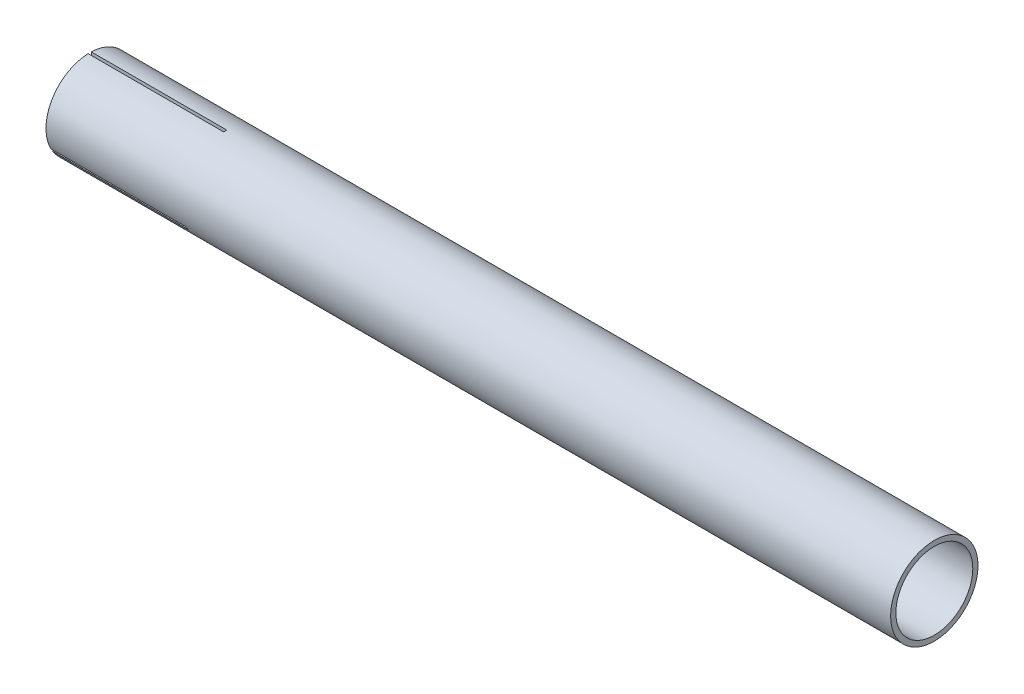
ISO-10303-21;
HEADER;
FILE_DESCRIPTION(('STEP AP214'),'2;1');
FILE_NAME('part.step','',(''),(''),'','','');
FILE_SCHEMA(('AUTOMOTIVE_DESIGN { 1 0 10303 214 1 1 1 1 }'));
ENDSEC;
DATA;
#1=APPLICATION_CONTEXT('core data for automotive mechanical design processes');
#2=APPLICATION_PROTOCOL_DEFINITION('international standard','automotive_design',2000,#1);
#3=PRODUCT_CONTEXT('',#1,'mechanical');
#4=PRODUCT('Part','Part','',(#3));
#5=PRODUCT_RELATED_PRODUCT_CATEGORY('part','',(#4));
#6=PRODUCT_DEFINITION_FORMATION('','',#4);
#7=PRODUCT_DEFINITION_CONTEXT('part definition',#1,'design');
#8=PRODUCT_DEFINITION('design','',#6,#7);
#9=PRODUCT_DEFINITION_SHAPE('','',#8);
#10=(LENGTH_UNIT() NAMED_UNIT(*) SI_UNIT(.MILLI.,.METRE.));
#11=(NAMED_UNIT(*) PLANE_ANGLE_UNIT() SI_UNIT($,.RADIAN.));
#12=(NAMED_UNIT(*) SI_UNIT($,.STERADIAN.) SOLID_ANGLE_UNIT());
#13=UNCERTAINTY_MEASURE_WITH_UNIT(LENGTH_MEASURE(1.E-05),#10,'distance_accuracy_value','');
#14=(GEOMETRIC_REPRESENTATION_CONTEXT(3) GLOBAL_UNCERTAINTY_ASSIGNED_CONTEXT((#13)) GLOBAL_UNIT_ASSIGNED_CONTEXT((#10,
#11,#12)) REPRESENTATION_CONTEXT('',''));
#15=CARTESIAN_POINT('',(0.,0.,0.));
#16=DIRECTION('',(0.,0.,1.));
#17=DIRECTION('',(1.,0.,0.));
#18=AXIS2_PLACEMENT_3D('',#15,#16,#17);
#19=CARTESIAN_POINT('',(810.,0.,0.));
#20=DIRECTION('',(-1.,0.,0.));
#21=DIRECTION('',(0.,0.,1.));
#22=AXIS2_PLACEMENT_3D('',#19,#20,#21);
#23=CYLINDRICAL_SURFACE('',#22,36.9);
#24=CARTESIAN_POINT('',(130.,0.,0.));
#25=DIRECTION('',(1.,0.,0.));
#26=DIRECTION('',(0.,0.,-1.));
#27=AXIS2_PLACEMENT_3D('',#24,#25,#26);
#28=CIRCLE('',#27,36.9);
#29=CARTESIAN_POINT('',(130.,36.8694995897693,-1.5));
#30=VERTEX_POINT('',#29);
#31=CARTESIAN_POINT('',(130.,36.8694995897693,1.5));
#32=VERTEX_POINT('',#31);
#33=EDGE_CURVE('E268',#30,#32,#28,.T.);
#34=ORIENTED_EDGE('',*,*,#33,.F.);
#35=DIRECTION('',(-1.,0.,0.));
#36=VECTOR('',#35,1.);
#37=CARTESIAN_POINT('',(810.,36.8694995897693,-1.5));
#38=LINE('',#37,#36);
#39=CARTESIAN_POINT('',(0.,36.8694995897693,-1.5));
#40=VERTEX_POINT('',#39);
#41=EDGE_CURVE('E116',#30,#40,#38,.T.);
#42=ORIENTED_EDGE('',*,*,#41,.T.);
#43=CARTESIAN_POINT('',(0.,0.,0.));
#44=DIRECTION('',(1.,0.,0.));
#45=DIRECTION('',(0.,0.,-1.));
#46=AXIS2_PLACEMENT_3D('',#43,#44,#45);
#47=CIRCLE('',#46,36.9);
#48=CARTESIAN_POINT('',(0.,-17.1357116892077,-32.6799232695603));
#49=VERTEX_POINT('',#48);
#50=EDGE_CURVE('E233',#49,#40,#47,.T.);
#51=ORIENTED_EDGE('',*,*,#50,.F.);
#52=DIRECTION('',(-1.,0.,0.));
#53=VECTOR('',#52,1.);
#54=CARTESIAN_POINT('',(810.,-17.1357116892077,-32.6799232695603));
#55=LINE('',#54,#53);
#56=CARTESIAN_POINT('',(130.,-17.1357116892077,-32.6799232695603));
#57=VERTEX_POINT('',#56);
#58=EDGE_CURVE('E263',#57,#49,#55,.T.);
#59=ORIENTED_EDGE('',*,*,#58,.F.);
#60=CARTESIAN_POINT('',(130.,-19.733787900561,-31.1799232695604));
#61=VERTEX_POINT('',#60);
#62=EDGE_CURVE('E216',#61,#57,#28,.T.);
#63=ORIENTED_EDGE('',*,*,#62,.F.);
#64=DIRECTION('',(-1.,0.,0.));
#65=VECTOR('',#64,1.);
#66=CARTESIAN_POINT('',(810.,-19.733787900561,-31.1799232695603));
#67=LINE('',#66,#65);
#68=CARTESIAN_POINT('',(0.,-19.733787900561,-31.1799232695604));
#69=VERTEX_POINT('',#68);
#70=EDGE_CURVE('E266',#61,#69,#67,.T.);
#71=ORIENTED_EDGE('',*,*,#70,.T.);
#72=CARTESIAN_POINT('',(0.,-19.7337879005615,31.1799232695601));
#73=VERTEX_POINT('',#72);
#74=EDGE_CURVE('E236',#73,#69,#47,.T.);
#75=ORIENTED_EDGE('',*,*,#74,.F.);
#76=DIRECTION('',(-1.,0.,0.));
#77=VECTOR('',#76,1.);
#78=CARTESIAN_POINT('',(810.,-19.7337879005615,31.1799232695601));
#79=LINE('',#78,#77);
#80=CARTESIAN_POINT('',(130.,-19.7337879005615,31.1799232695601));
#81=VERTEX_POINT('',#80);
#82=EDGE_CURVE('E273',#81,#73,#79,.T.);
#83=ORIENTED_EDGE('',*,*,#82,.F.);
#84=CARTESIAN_POINT('',(130.,-17.1357116892082,32.6799232695601));
#85=VERTEX_POINT('',#84);
#86=EDGE_CURVE('E269',#85,#81,#28,.T.);
#87=ORIENTED_EDGE('',*,*,#86,.F.);
#88=DIRECTION('',(-1.,0.,0.));
#89=VECTOR('',#88,1.);
#90=CARTESIAN_POINT('',(810.,-17.1357116892081,32.6799232695601));
#91=LINE('',#90,#89);
#92=CARTESIAN_POINT('',(0.,-17.1357116892082,32.6799232695601));
#93=VERTEX_POINT('',#92);
#94=EDGE_CURVE('E275',#85,#93,#91,.T.);
#95=ORIENTED_EDGE('',*,*,#94,.T.);
#96=CARTESIAN_POINT('',(0.,36.8694995897693,1.5));
#97=VERTEX_POINT('',#96);
#98=EDGE_CURVE('E238',#97,#93,#47,.T.);
#99=ORIENTED_EDGE('',*,*,#98,.F.);
#100=DIRECTION('',(-1.,0.,0.));
#101=VECTOR('',#100,1.);
#102=CARTESIAN_POINT('',(810.,36.8694995897693,1.5));
#103=LINE('',#102,#101);
#104=EDGE_CURVE('E278',#32,#97,#103,.T.);
#105=ORIENTED_EDGE('',*,*,#104,.F.);
#106=EDGE_LOOP('',(#34,#42,#51,#59,#63,#71,#75,#83,#87,#95,#99,#105));
#107=FACE_BOUND('',#106,.T.);
#108=CARTESIAN_POINT('',(610.,0.,0.));
#109=DIRECTION('',(1.,0.,0.));
#110=DIRECTION('',(0.,0.,-1.));
#111=AXIS2_PLACEMENT_3D('',#108,#109,#110);
#112=CIRCLE('',#111,36.9);
#113=CARTESIAN_POINT('',(610.,0.,-36.9));
#114=VERTEX_POINT('',#113);
#115=EDGE_CURVE('E310',#114,#114,#112,.T.);
#116=ORIENTED_EDGE('',*,*,#115,.T.);
#117=EDGE_LOOP('',(#116));
#118=FACE_BOUND('',#117,.T.);
#119=ADVANCED_FACE('F108',(#107,#118),#23,.F.);
#120=CARTESIAN_POINT('',(0.,0.,0.));
#121=DIRECTION('',(1.,0.,0.));
#122=DIRECTION('',(0.,0.,-1.));
#123=AXIS2_PLACEMENT_3D('',#120,#121,#122);
#124=PLANE('',#123);
#125=DIRECTION('',(0.,1.,0.));
#126=VECTOR('',#125,1.);
#127=CARTESIAN_POINT('',(0.,0.,-1.5));
#128=LINE('',#127,#126);
#129=CARTESIAN_POINT('',(0.,41.8731417498138,-1.5));
#130=VERTEX_POINT('',#129);
#131=EDGE_CURVE('E322',#40,#130,#128,.T.);
#132=ORIENTED_EDGE('',*,*,#131,.T.);
#133=CARTESIAN_POINT('',(0.,0.,0.));
#134=DIRECTION('',(1.,0.,0.));
#135=DIRECTION('',(0.,0.,-1.));
#136=AXIS2_PLACEMENT_3D('',#133,#134,#135);
#137=CIRCLE('',#136,41.9);
#138=CARTESIAN_POINT('',(0.,-19.6375327692299,-37.0132044916057));
#139=VERTEX_POINT('',#138);
#140=EDGE_CURVE('E251',#139,#130,#137,.T.);
#141=ORIENTED_EDGE('',*,*,#140,.F.);
#142=DIRECTION('',(0.,-0.499999999999992,-0.866025403784443));
#143=VECTOR('',#142,1.);
#144=CARTESIAN_POINT('',(0.,1.29903810567666,-0.749999999999988));
#145=LINE('',#144,#143);
#146=EDGE_CURVE('E202',#49,#139,#145,.T.);
#147=ORIENTED_EDGE('',*,*,#146,.F.);
#148=ORIENTED_EDGE('',*,*,#50,.T.);
#149=EDGE_LOOP('',(#132,#141,#147,#148));
#150=FACE_BOUND('',#149,.T.);
#151=ADVANCED_FACE('F346',(#150),#124,.F.);
#152=CARTESIAN_POINT('',(0.,41.8731417498138,1.5));
#153=VERTEX_POINT('',#152);
#154=CARTESIAN_POINT('',(0.,-19.6375327692304,37.0132044916054));
#155=VERTEX_POINT('',#154);
#156=EDGE_CURVE('E256',#153,#155,#137,.T.);
#157=ORIENTED_EDGE('',*,*,#156,.F.);
#158=DIRECTION('',(0.,1.,0.));
#159=VECTOR('',#158,1.);
#160=CARTESIAN_POINT('',(0.,0.,1.5));
#161=LINE('',#160,#159);
#162=EDGE_CURVE('E318',#97,#153,#161,.T.);
#163=ORIENTED_EDGE('',*,*,#162,.F.);
#164=ORIENTED_EDGE('',*,*,#98,.T.);
#165=DIRECTION('',(0.,-0.500000000000004,0.866025403784436));
#166=VECTOR('',#165,1.);
#167=CARTESIAN_POINT('',(0.,1.29903810567665,0.750000000000006));
#168=LINE('',#167,#166);
#169=EDGE_CURVE('E302',#93,#155,#168,.T.);
#170=ORIENTED_EDGE('',*,*,#169,.T.);
#171=EDGE_LOOP('',(#157,#163,#164,#170));
#172=FACE_BOUND('',#171,.T.);
#173=ADVANCED_FACE('F317',(#172),#124,.F.);
#174=CARTESIAN_POINT('',(0.,-22.2356089805837,35.5132044916054));
#175=VERTEX_POINT('',#174);
#176=CARTESIAN_POINT('',(0.,-22.2356089805832,-35.5132044916057));
#177=VERTEX_POINT('',#176);
#178=EDGE_CURVE('E254',#175,#177,#137,.T.);
#179=ORIENTED_EDGE('',*,*,#178,.F.);
#180=DIRECTION('',(0.,-0.500000000000004,0.866025403784436));
#181=VECTOR('',#180,1.);
#182=CARTESIAN_POINT('',(0.,-1.29903810567665,-0.750000000000006));
#183=LINE('',#182,#181);
#184=EDGE_CURVE('E296',#73,#175,#183,.T.);
#185=ORIENTED_EDGE('',*,*,#184,.F.);
#186=ORIENTED_EDGE('',*,*,#74,.T.);
#187=DIRECTION('',(0.,-0.499999999999992,-0.866025403784443));
#188=VECTOR('',#187,1.);
#189=CARTESIAN_POINT('',(0.,-1.29903810567666,0.749999999999988));
#190=LINE('',#189,#188);
#191=EDGE_CURVE('E219',#69,#177,#190,.T.);
#192=ORIENTED_EDGE('',*,*,#191,.T.);
#193=EDGE_LOOP('',(#179,#185,#186,#192));
#194=FACE_BOUND('',#193,.T.);
#195=ADVANCED_FACE('F300',(#194),#124,.F.);
#196=CARTESIAN_POINT('',(810.,0.,0.));
#197=DIRECTION('',(-1.,0.,0.));
#198=DIRECTION('',(0.,0.,1.));
#199=AXIS2_PLACEMENT_3D('',#196,#197,#198);
#200=CYLINDRICAL_SURFACE('',#199,41.9);
#201=CARTESIAN_POINT('',(810.,0.,0.));
#202=DIRECTION('',(1.,0.,0.));
#203=DIRECTION('',(0.,0.,-1.));
#204=AXIS2_PLACEMENT_3D('',#201,#202,#203);
#205=CIRCLE('',#204,41.9);
#206=CARTESIAN_POINT('',(810.,0.,-41.9));
#207=VERTEX_POINT('',#206);
#208=EDGE_CURVE('E259',#207,#207,#205,.T.);
#209=ORIENTED_EDGE('',*,*,#208,.F.);
#210=EDGE_LOOP('',(#209));
#211=FACE_BOUND('',#210,.T.);
#212=DIRECTION('',(-1.,0.,0.));
#213=VECTOR('',#212,1.);
#214=CARTESIAN_POINT('',(810.,41.8731417498138,-1.5));
#215=LINE('',#214,#213);
#216=CARTESIAN_POINT('',(130.,41.8731417498138,-1.5));
#217=VERTEX_POINT('',#216);
#218=EDGE_CURVE('E225',#217,#130,#215,.T.);
#219=ORIENTED_EDGE('',*,*,#218,.F.);
#220=CARTESIAN_POINT('',(130.,0.,0.));
#221=DIRECTION('',(1.,0.,0.));
#222=DIRECTION('',(0.,0.,-1.));
#223=AXIS2_PLACEMENT_3D('',#220,#221,#222);
#224=CIRCLE('',#223,41.9);
#225=CARTESIAN_POINT('',(130.,41.8731417498138,1.5));
#226=VERTEX_POINT('',#225);
#227=EDGE_CURVE('E227',#217,#226,#224,.T.);
#228=ORIENTED_EDGE('',*,*,#227,.T.);
#229=DIRECTION('',(-1.,0.,0.));
#230=VECTOR('',#229,1.);
#231=CARTESIAN_POINT('',(810.,41.8731417498138,1.5));
#232=LINE('',#231,#230);
#233=EDGE_CURVE('E229',#226,#153,#232,.T.);
#234=ORIENTED_EDGE('',*,*,#233,.T.);
#235=ORIENTED_EDGE('',*,*,#156,.T.);
#236=DIRECTION('',(-1.,0.,0.));
#237=VECTOR('',#236,1.);
#238=CARTESIAN_POINT('',(810.,-19.6375327692304,37.0132044916054));
#239=LINE('',#238,#237);
#240=CARTESIAN_POINT('',(130.,-19.6375327692304,37.0132044916054));
#241=VERTEX_POINT('',#240);
#242=EDGE_CURVE('E315',#241,#155,#239,.T.);
#243=ORIENTED_EDGE('',*,*,#242,.F.);
#244=CARTESIAN_POINT('',(130.,-22.2356089805837,35.5132044916054));
#245=VERTEX_POINT('',#244);
#246=EDGE_CURVE('E224',#241,#245,#224,.T.);
#247=ORIENTED_EDGE('',*,*,#246,.T.);
#248=DIRECTION('',(-1.,0.,0.));
#249=VECTOR('',#248,1.);
#250=CARTESIAN_POINT('',(810.,-22.2356089805837,35.5132044916054));
#251=LINE('',#250,#249);
#252=EDGE_CURVE('E313',#245,#175,#251,.T.);
#253=ORIENTED_EDGE('',*,*,#252,.T.);
#254=ORIENTED_EDGE('',*,*,#178,.T.);
#255=DIRECTION('',(-1.,0.,0.));
#256=VECTOR('',#255,1.);
#257=CARTESIAN_POINT('',(810.,-22.2356089805832,-35.5132044916057));
#258=LINE('',#257,#256);
#259=CARTESIAN_POINT('',(130.,-22.2356089805832,-35.5132044916057));
#260=VERTEX_POINT('',#259);
#261=EDGE_CURVE('E207',#260,#177,#258,.T.);
#262=ORIENTED_EDGE('',*,*,#261,.F.);
#263=CARTESIAN_POINT('',(130.,-19.6375327692299,-37.0132044916057));
#264=VERTEX_POINT('',#263);
#265=EDGE_CURVE('E213',#260,#264,#224,.T.);
#266=ORIENTED_EDGE('',*,*,#265,.T.);
#267=DIRECTION('',(-1.,0.,0.));
#268=VECTOR('',#267,1.);
#269=CARTESIAN_POINT('',(810.,-19.6375327692299,-37.0132044916057));
#270=LINE('',#269,#268);
#271=EDGE_CURVE('E196',#264,#139,#270,.T.);
#272=ORIENTED_EDGE('',*,*,#271,.T.);
#273=ORIENTED_EDGE('',*,*,#140,.T.);
#274=EDGE_LOOP('',(#219,#228,#234,#235,#243,#247,#253,#254,#262,#266,#272,#273));
#275=FACE_BOUND('',#274,.T.);
#276=ADVANCED_FACE('F110',(#211,#275),#200,.T.);
#277=CARTESIAN_POINT('',(612.,0.,0.));
#278=DIRECTION('',(1.,0.,0.));
#279=DIRECTION('',(0.,0.,-1.));
#280=AXIS2_PLACEMENT_3D('',#277,#278,#279);
#281=CIRCLE('',#280,36.9);
#282=CARTESIAN_POINT('',(612.,0.,-36.9));
#283=VERTEX_POINT('',#282);
#284=EDGE_CURVE('E12',#283,#283,#281,.T.);
#285=ORIENTED_EDGE('',*,*,#284,.F.);
#286=EDGE_LOOP('',(#285));
#287=FACE_BOUND('',#286,.T.);
#288=CARTESIAN_POINT('',(810.,0.,0.));
#289=DIRECTION('',(1.,0.,0.));
#290=DIRECTION('',(0.,0.,-1.));
#291=AXIS2_PLACEMENT_3D('',#288,#289,#290);
#292=CIRCLE('',#291,36.9);
#293=CARTESIAN_POINT('',(810.,0.,-36.9));
#294=VERTEX_POINT('',#293);
#295=EDGE_CURVE('E245',#294,#294,#292,.T.);
#296=ORIENTED_EDGE('',*,*,#295,.T.);
#297=EDGE_LOOP('',(#296));
#298=FACE_BOUND('',#297,.T.);
#299=ADVANCED_FACE('F348',(#287,#298),#23,.F.);
#300=CARTESIAN_POINT('',(810.,0.,0.));
#301=DIRECTION('',(1.,0.,0.));
#302=DIRECTION('',(0.,0.,-1.));
#303=AXIS2_PLACEMENT_3D('',#300,#301,#302);
#304=PLANE('',#303);
#305=ORIENTED_EDGE('',*,*,#208,.T.);
#306=EDGE_LOOP('',(#305));
#307=FACE_BOUND('',#306,.T.);
#308=ORIENTED_EDGE('',*,*,#295,.F.);
#309=EDGE_LOOP('',(#308));
#310=FACE_BOUND('',#309,.T.);
#311=ADVANCED_FACE('F355',(#307,#310),#304,.T.);
#312=CARTESIAN_POINT('',(130.,1.29903810567666,-0.749999999999988));
#313=DIRECTION('',(0.,0.866025403784443,-0.499999999999992));
#314=DIRECTION('',(0.,0.499999999999992,0.866025403784443));
#315=AXIS2_PLACEMENT_3D('',#312,#313,#314);
#316=PLANE('',#315);
#317=DIRECTION('',(0.,-0.499999999999992,-0.866025403784443));
#318=VECTOR('',#317,1.);
#319=CARTESIAN_POINT('',(130.,1.29903810567666,-0.749999999999988));
#320=LINE('',#319,#318);
#321=EDGE_CURVE('E199',#57,#264,#320,.T.);
#322=ORIENTED_EDGE('',*,*,#321,.F.);
#323=ORIENTED_EDGE('',*,*,#58,.T.);
#324=ORIENTED_EDGE('',*,*,#146,.T.);
#325=ORIENTED_EDGE('',*,*,#271,.F.);
#326=EDGE_LOOP('',(#322,#323,#324,#325));
#327=FACE_BOUND('',#326,.T.);
#328=ADVANCED_FACE('F198',(#327),#316,.F.);
#329=CARTESIAN_POINT('',(130.,-1.29903810567666,0.749999999999988));
#330=DIRECTION('',(0.,0.866025403784443,-0.499999999999992));
#331=DIRECTION('',(0.,0.499999999999992,0.866025403784443));
#332=AXIS2_PLACEMENT_3D('',#329,#330,#331);
#333=PLANE('',#332);
#334=ORIENTED_EDGE('',*,*,#261,.T.);
#335=ORIENTED_EDGE('',*,*,#191,.F.);
#336=ORIENTED_EDGE('',*,*,#70,.F.);
#337=DIRECTION('',(0.,-0.499999999999992,-0.866025403784443));
#338=VECTOR('',#337,1.);
#339=CARTESIAN_POINT('',(130.,-1.29903810567666,0.749999999999988));
#340=LINE('',#339,#338);
#341=EDGE_CURVE('E218',#61,#260,#340,.T.);
#342=ORIENTED_EDGE('',*,*,#341,.T.);
#343=EDGE_LOOP('',(#334,#335,#336,#342));
#344=FACE_BOUND('',#343,.T.);
#345=ADVANCED_FACE('F391',(#344),#333,.T.);
#346=CARTESIAN_POINT('',(130.,0.,0.));
#347=DIRECTION('',(1.,0.,0.));
#348=DIRECTION('',(0.,0.,-1.));
#349=AXIS2_PLACEMENT_3D('',#346,#347,#348);
#350=PLANE('',#349);
#351=ORIENTED_EDGE('',*,*,#341,.F.);
#352=ORIENTED_EDGE('',*,*,#62,.T.);
#353=ORIENTED_EDGE('',*,*,#321,.T.);
#354=ORIENTED_EDGE('',*,*,#265,.F.);
#355=EDGE_LOOP('',(#351,#352,#353,#354));
#356=FACE_BOUND('',#355,.T.);
#357=ADVANCED_FACE('F212',(#356),#350,.F.);
#358=CARTESIAN_POINT('',(130.,-1.29903810567665,-0.750000000000006));
#359=DIRECTION('',(0.,-0.866025403784436,-0.500000000000004));
#360=DIRECTION('',(0.,0.500000000000004,-0.866025403784436));
#361=AXIS2_PLACEMENT_3D('',#358,#359,#360);
#362=PLANE('',#361);
#363=DIRECTION('',(0.,-0.500000000000004,0.866025403784436));
#364=VECTOR('',#363,1.);
#365=CARTESIAN_POINT('',(130.,-1.29903810567665,-0.750000000000006));
#366=LINE('',#365,#364);
#367=EDGE_CURVE('E131',#81,#245,#366,.T.);
#368=ORIENTED_EDGE('',*,*,#367,.F.);
#369=ORIENTED_EDGE('',*,*,#82,.T.);
#370=ORIENTED_EDGE('',*,*,#184,.T.);
#371=ORIENTED_EDGE('',*,*,#252,.F.);
#372=EDGE_LOOP('',(#368,#369,#370,#371));
#373=FACE_BOUND('',#372,.T.);
#374=ADVANCED_FACE('F295',(#373),#362,.F.);
#375=CARTESIAN_POINT('',(130.,1.29903810567665,0.750000000000006));
#376=DIRECTION('',(0.,-0.866025403784436,-0.500000000000004));
#377=DIRECTION('',(0.,0.500000000000004,-0.866025403784436));
#378=AXIS2_PLACEMENT_3D('',#375,#376,#377);
#379=PLANE('',#378);
#380=ORIENTED_EDGE('',*,*,#242,.T.);
#381=ORIENTED_EDGE('',*,*,#169,.F.);
#382=ORIENTED_EDGE('',*,*,#94,.F.);
#383=DIRECTION('',(0.,-0.500000000000004,0.866025403784436));
#384=VECTOR('',#383,1.);
#385=CARTESIAN_POINT('',(130.,1.29903810567665,0.750000000000006));
#386=LINE('',#385,#384);
#387=EDGE_CURVE('E291',#85,#241,#386,.T.);
#388=ORIENTED_EDGE('',*,*,#387,.T.);
#389=EDGE_LOOP('',(#380,#381,#382,#388));
#390=FACE_BOUND('',#389,.T.);
#391=ADVANCED_FACE('F320',(#390),#379,.T.);
#392=ORIENTED_EDGE('',*,*,#387,.F.);
#393=ORIENTED_EDGE('',*,*,#86,.T.);
#394=ORIENTED_EDGE('',*,*,#367,.T.);
#395=ORIENTED_EDGE('',*,*,#246,.F.);
#396=EDGE_LOOP('',(#392,#393,#394,#395));
#397=FACE_BOUND('',#396,.T.);
#398=ADVANCED_FACE('F289',(#397),#350,.F.);
#399=DIRECTION('',(0.,1.,0.));
#400=VECTOR('',#399,1.);
#401=CARTESIAN_POINT('',(130.,0.,-1.5));
#402=LINE('',#401,#400);
#403=EDGE_CURVE('E208',#30,#217,#402,.T.);
#404=ORIENTED_EDGE('',*,*,#403,.F.);
#405=ORIENTED_EDGE('',*,*,#33,.T.);
#406=DIRECTION('',(0.,1.,0.));
#407=VECTOR('',#406,1.);
#408=CARTESIAN_POINT('',(130.,0.,1.5));
#409=LINE('',#408,#407);
#410=EDGE_CURVE('E123',#32,#226,#409,.T.);
#411=ORIENTED_EDGE('',*,*,#410,.T.);
#412=ORIENTED_EDGE('',*,*,#227,.F.);
#413=EDGE_LOOP('',(#404,#405,#411,#412));
#414=FACE_BOUND('',#413,.T.);
#415=ADVANCED_FACE('F403',(#414),#350,.F.);
#416=CARTESIAN_POINT('',(130.,0.,-1.5));
#417=DIRECTION('',(0.,0.,1.));
#418=DIRECTION('',(1.,0.,0.));
#419=AXIS2_PLACEMENT_3D('',#416,#417,#418);
#420=PLANE('',#419);
#421=ORIENTED_EDGE('',*,*,#218,.T.);
#422=ORIENTED_EDGE('',*,*,#131,.F.);
#423=ORIENTED_EDGE('',*,*,#41,.F.);
#424=ORIENTED_EDGE('',*,*,#403,.T.);
#425=EDGE_LOOP('',(#421,#422,#423,#424));
#426=FACE_BOUND('',#425,.T.);
#427=ADVANCED_FACE('F342',(#426),#420,.T.);
#428=CARTESIAN_POINT('',(130.,0.,1.5));
#429=DIRECTION('',(0.,0.,1.));
#430=DIRECTION('',(1.,0.,0.));
#431=AXIS2_PLACEMENT_3D('',#428,#429,#430);
#432=PLANE('',#431);
#433=ORIENTED_EDGE('',*,*,#410,.F.);
#434=ORIENTED_EDGE('',*,*,#104,.T.);
#435=ORIENTED_EDGE('',*,*,#162,.T.);
#436=ORIENTED_EDGE('',*,*,#233,.F.);
#437=EDGE_LOOP('',(#433,#434,#435,#436));
#438=FACE_BOUND('',#437,.T.);
#439=ADVANCED_FACE('F321',(#438),#432,.F.);
#440=CARTESIAN_POINT('',(610.,0.,0.));
#441=DIRECTION('',(1.,0.,0.));
#442=DIRECTION('',(0.,0.,-1.));
#443=AXIS2_PLACEMENT_3D('',#440,#441,#442);
#444=PLANE('',#443);
#445=ORIENTED_EDGE('',*,*,#115,.F.);
#446=EDGE_LOOP('',(#445));
#447=FACE_BOUND('',#446,.T.);
#448=ADVANCED_FACE('F332',(#447),#444,.F.);
#449=CARTESIAN_POINT('',(612.,0.,0.));
#450=DIRECTION('',(1.,0.,0.));
#451=DIRECTION('',(0.,0.,-1.));
#452=AXIS2_PLACEMENT_3D('',#449,#450,#451);
#453=PLANE('',#452);
#454=ORIENTED_EDGE('',*,*,#284,.T.);
#455=EDGE_LOOP('',(#454));
#456=FACE_BOUND('',#455,.T.);
#457=ADVANCED_FACE('F334',(#456),#453,.T.);
#458=CLOSED_SHELL('',(#119,#151,#173,#195,#276,#299,#311,#328,#345,#357,#374,#391,#398,#415,
#427,#439,#448,#457));
#459=MANIFOLD_SOLID_BREP('B2',#458);
#460=ADVANCED_BREP_SHAPE_REPRESENTATION('',(#18,#459),#14);
#461=SHAPE_DEFINITION_REPRESENTATION(#9,#460);
ENDSEC;
END-ISO-10303-21;
